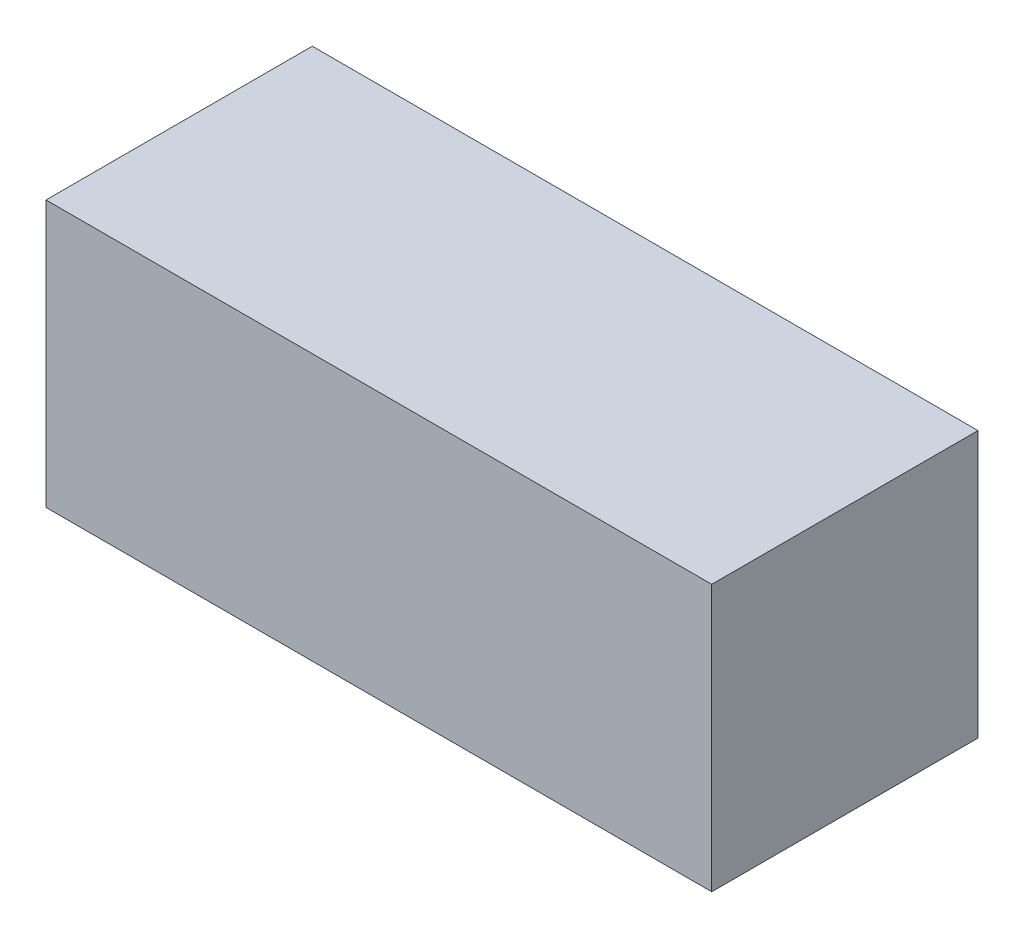
ISO-10303-21;
HEADER;
FILE_DESCRIPTION(('STEP AP214'),'2;1');
FILE_NAME('part.step','',(''),(''),'','','');
FILE_SCHEMA(('AUTOMOTIVE_DESIGN { 1 0 10303 214 1 1 1 1 }'));
ENDSEC;
DATA;
#1=APPLICATION_CONTEXT('core data for automotive mechanical design processes');
#2=APPLICATION_PROTOCOL_DEFINITION('international standard','automotive_design',2000,#1);
#3=PRODUCT_CONTEXT('',#1,'mechanical');
#4=PRODUCT('Part','Part','',(#3));
#5=PRODUCT_RELATED_PRODUCT_CATEGORY('part','',(#4));
#6=PRODUCT_DEFINITION_FORMATION('','',#4);
#7=PRODUCT_DEFINITION_CONTEXT('part definition',#1,'design');
#8=PRODUCT_DEFINITION('design','',#6,#7);
#9=PRODUCT_DEFINITION_SHAPE('','',#8);
#10=(LENGTH_UNIT() NAMED_UNIT(*) SI_UNIT(.MILLI.,.METRE.));
#11=(NAMED_UNIT(*) PLANE_ANGLE_UNIT() SI_UNIT($,.RADIAN.));
#12=(NAMED_UNIT(*) SI_UNIT($,.STERADIAN.) SOLID_ANGLE_UNIT());
#13=UNCERTAINTY_MEASURE_WITH_UNIT(LENGTH_MEASURE(1.E-05),#10,'distance_accuracy_value','');
#14=(GEOMETRIC_REPRESENTATION_CONTEXT(3) GLOBAL_UNCERTAINTY_ASSIGNED_CONTEXT((#13)) GLOBAL_UNIT_ASSIGNED_CONTEXT((#10,
#11,#12)) REPRESENTATION_CONTEXT('',''));
#15=CARTESIAN_POINT('',(0.,0.,0.));
#16=DIRECTION('',(0.,0.,1.));
#17=DIRECTION('',(1.,0.,0.));
#18=AXIS2_PLACEMENT_3D('',#15,#16,#17);
#19=CARTESIAN_POINT('',(0.,25.4,0.));
#20=DIRECTION('',(1.,0.,0.));
#21=DIRECTION('',(0.,0.,-1.));
#22=AXIS2_PLACEMENT_3D('',#19,#20,#21);
#23=PLANE('',#22);
#24=DIRECTION('',(0.,0.,1.));
#25=VECTOR('',#24,1.);
#26=CARTESIAN_POINT('',(0.,0.,0.));
#27=LINE('',#26,#25);
#28=CARTESIAN_POINT('',(0.,0.,-25.4));
#29=VERTEX_POINT('',#28);
#30=CARTESIAN_POINT('',(0.,0.,0.));
#31=VERTEX_POINT('',#30);
#32=EDGE_CURVE('E80',#29,#31,#27,.T.);
#33=ORIENTED_EDGE('',*,*,#32,.T.);
#34=DIRECTION('',(0.,-1.,0.));
#35=VECTOR('',#34,1.);
#36=CARTESIAN_POINT('',(0.,25.4,0.));
#37=LINE('',#36,#35);
#38=CARTESIAN_POINT('',(0.,25.4,0.));
#39=VERTEX_POINT('',#38);
#40=EDGE_CURVE('E11',#39,#31,#37,.T.);
#41=ORIENTED_EDGE('',*,*,#40,.F.);
#42=DIRECTION('',(0.,0.,1.));
#43=VECTOR('',#42,1.);
#44=CARTESIAN_POINT('',(0.,25.4,0.));
#45=LINE('',#44,#43);
#46=CARTESIAN_POINT('',(0.,25.4,-25.4));
#47=VERTEX_POINT('',#46);
#48=EDGE_CURVE('E68',#47,#39,#45,.T.);
#49=ORIENTED_EDGE('',*,*,#48,.F.);
#50=DIRECTION('',(0.,-1.,0.));
#51=VECTOR('',#50,1.);
#52=CARTESIAN_POINT('',(0.,25.4,-25.4));
#53=LINE('',#52,#51);
#54=EDGE_CURVE('E76',#47,#29,#53,.T.);
#55=ORIENTED_EDGE('',*,*,#54,.T.);
#56=EDGE_LOOP('',(#33,#41,#49,#55));
#57=FACE_BOUND('',#56,.T.);
#58=ADVANCED_FACE('F17',(#57),#23,.F.);
#59=CARTESIAN_POINT('',(0.,25.4,0.));
#60=DIRECTION('',(0.,0.,-1.));
#61=DIRECTION('',(-1.,0.,0.));
#62=AXIS2_PLACEMENT_3D('',#59,#60,#61);
#63=PLANE('',#62);
#64=DIRECTION('',(1.,0.,0.));
#65=VECTOR('',#64,1.);
#66=CARTESIAN_POINT('',(0.,0.,0.));
#67=LINE('',#66,#65);
#68=CARTESIAN_POINT('',(63.5,0.,0.));
#69=VERTEX_POINT('',#68);
#70=EDGE_CURVE('E72',#31,#69,#67,.T.);
#71=ORIENTED_EDGE('',*,*,#70,.T.);
#72=DIRECTION('',(0.,-1.,0.));
#73=VECTOR('',#72,1.);
#74=CARTESIAN_POINT('',(63.5,25.4,0.));
#75=LINE('',#74,#73);
#76=CARTESIAN_POINT('',(63.5,25.4,0.));
#77=VERTEX_POINT('',#76);
#78=EDGE_CURVE('E25',#77,#69,#75,.T.);
#79=ORIENTED_EDGE('',*,*,#78,.F.);
#80=DIRECTION('',(1.,0.,0.));
#81=VECTOR('',#80,1.);
#82=CARTESIAN_POINT('',(0.,25.4,0.));
#83=LINE('',#82,#81);
#84=EDGE_CURVE('E63',#39,#77,#83,.T.);
#85=ORIENTED_EDGE('',*,*,#84,.F.);
#86=ORIENTED_EDGE('',*,*,#40,.T.);
#87=EDGE_LOOP('',(#71,#79,#85,#86));
#88=FACE_BOUND('',#87,.T.);
#89=ADVANCED_FACE('F71',(#88),#63,.F.);
#90=CARTESIAN_POINT('',(63.5,25.4,0.));
#91=DIRECTION('',(-1.,0.,0.));
#92=DIRECTION('',(0.,0.,1.));
#93=AXIS2_PLACEMENT_3D('',#90,#91,#92);
#94=PLANE('',#93);
#95=DIRECTION('',(0.,0.,-1.));
#96=VECTOR('',#95,1.);
#97=CARTESIAN_POINT('',(63.5,0.,0.));
#98=LINE('',#97,#96);
#99=CARTESIAN_POINT('',(63.5,0.,-25.4));
#100=VERTEX_POINT('',#99);
#101=EDGE_CURVE('E50',#69,#100,#98,.T.);
#102=ORIENTED_EDGE('',*,*,#101,.T.);
#103=DIRECTION('',(0.,-1.,0.));
#104=VECTOR('',#103,1.);
#105=CARTESIAN_POINT('',(63.5,25.4,-25.4));
#106=LINE('',#105,#104);
#107=CARTESIAN_POINT('',(63.5,25.4,-25.4));
#108=VERTEX_POINT('',#107);
#109=EDGE_CURVE('E73',#108,#100,#106,.T.);
#110=ORIENTED_EDGE('',*,*,#109,.F.);
#111=DIRECTION('',(0.,0.,-1.));
#112=VECTOR('',#111,1.);
#113=CARTESIAN_POINT('',(63.5,25.4,0.));
#114=LINE('',#113,#112);
#115=EDGE_CURVE('E66',#77,#108,#114,.T.);
#116=ORIENTED_EDGE('',*,*,#115,.F.);
#117=ORIENTED_EDGE('',*,*,#78,.T.);
#118=EDGE_LOOP('',(#102,#110,#116,#117));
#119=FACE_BOUND('',#118,.T.);
#120=ADVANCED_FACE('F74',(#119),#94,.F.);
#121=CARTESIAN_POINT('',(0.,25.4,-25.4));
#122=DIRECTION('',(0.,0.,1.));
#123=DIRECTION('',(1.,0.,0.));
#124=AXIS2_PLACEMENT_3D('',#121,#122,#123);
#125=PLANE('',#124);
#126=DIRECTION('',(-1.,0.,0.));
#127=VECTOR('',#126,1.);
#128=CARTESIAN_POINT('',(0.,0.,-25.4));
#129=LINE('',#128,#127);
#130=EDGE_CURVE('E56',#100,#29,#129,.T.);
#131=ORIENTED_EDGE('',*,*,#130,.T.);
#132=ORIENTED_EDGE('',*,*,#54,.F.);
#133=DIRECTION('',(-1.,0.,0.));
#134=VECTOR('',#133,1.);
#135=CARTESIAN_POINT('',(0.,25.4,-25.4));
#136=LINE('',#135,#134);
#137=EDGE_CURVE('E33',#108,#47,#136,.T.);
#138=ORIENTED_EDGE('',*,*,#137,.F.);
#139=ORIENTED_EDGE('',*,*,#109,.T.);
#140=EDGE_LOOP('',(#131,#132,#138,#139));
#141=FACE_BOUND('',#140,.T.);
#142=ADVANCED_FACE('F87',(#141),#125,.F.);
#143=CARTESIAN_POINT('',(0.,25.4,-25.4));
#144=DIRECTION('',(0.,-1.,0.));
#145=DIRECTION('',(0.,0.,-1.));
#146=AXIS2_PLACEMENT_3D('',#143,#144,#145);
#147=PLANE('',#146);
#148=ORIENTED_EDGE('',*,*,#48,.T.);
#149=ORIENTED_EDGE('',*,*,#84,.T.);
#150=ORIENTED_EDGE('',*,*,#115,.T.);
#151=ORIENTED_EDGE('',*,*,#137,.T.);
#152=EDGE_LOOP('',(#148,#149,#150,#151));
#153=FACE_BOUND('',#152,.T.);
#154=ADVANCED_FACE('F64',(#153),#147,.F.);
#155=CARTESIAN_POINT('',(0.,0.,-25.4));
#156=DIRECTION('',(0.,-1.,0.));
#157=DIRECTION('',(0.,0.,-1.));
#158=AXIS2_PLACEMENT_3D('',#155,#156,#157);
#159=PLANE('',#158);
#160=ORIENTED_EDGE('',*,*,#32,.F.);
#161=ORIENTED_EDGE('',*,*,#130,.F.);
#162=ORIENTED_EDGE('',*,*,#101,.F.);
#163=ORIENTED_EDGE('',*,*,#70,.F.);
#164=EDGE_LOOP('',(#160,#161,#162,#163));
#165=FACE_BOUND('',#164,.T.);
#166=ADVANCED_FACE('F90',(#165),#159,.T.);
#167=CLOSED_SHELL('',(#58,#89,#120,#142,#154,#166));
#168=MANIFOLD_SOLID_BREP('B1',#167);
#169=ADVANCED_BREP_SHAPE_REPRESENTATION('',(#18,#168),#14);
#170=SHAPE_DEFINITION_REPRESENTATION(#9,#169);
ENDSEC;
END-ISO-10303-21;
